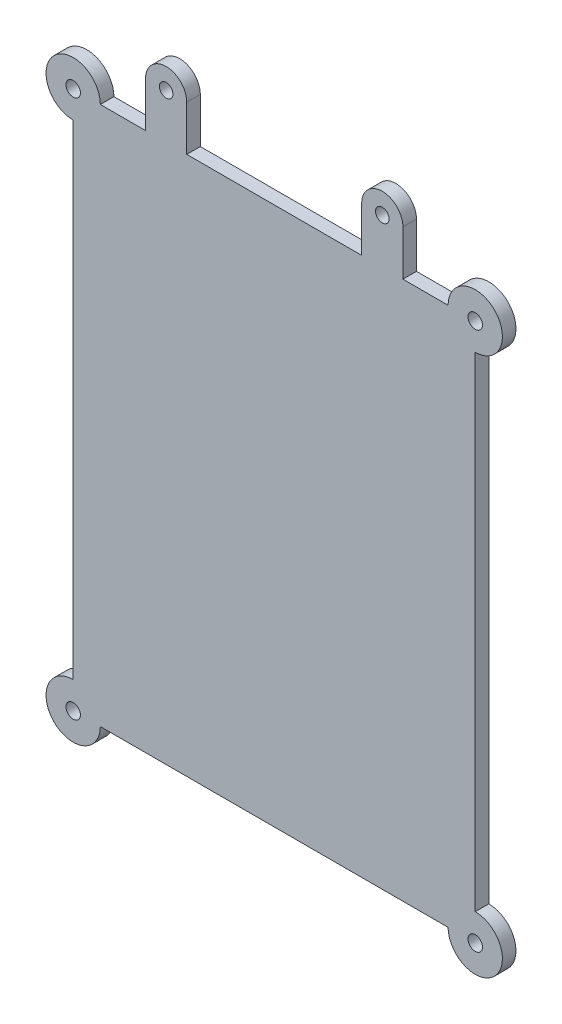
ISO-10303-21;
HEADER;
FILE_DESCRIPTION(('STEP AP214'),'2;1');
FILE_NAME('part.step','',(''),(''),'','','');
FILE_SCHEMA(('AUTOMOTIVE_DESIGN { 1 0 10303 214 1 1 1 1 }'));
ENDSEC;
DATA;
#1=APPLICATION_CONTEXT('core data for automotive mechanical design processes');
#2=APPLICATION_PROTOCOL_DEFINITION('international standard','automotive_design',2000,#1);
#3=PRODUCT_CONTEXT('',#1,'mechanical');
#4=PRODUCT('Part','Part','',(#3));
#5=PRODUCT_RELATED_PRODUCT_CATEGORY('part','',(#4));
#6=PRODUCT_DEFINITION_FORMATION('','',#4);
#7=PRODUCT_DEFINITION_CONTEXT('part definition',#1,'design');
#8=PRODUCT_DEFINITION('design','',#6,#7);
#9=PRODUCT_DEFINITION_SHAPE('','',#8);
#10=(LENGTH_UNIT() NAMED_UNIT(*) SI_UNIT(.MILLI.,.METRE.));
#11=(NAMED_UNIT(*) PLANE_ANGLE_UNIT() SI_UNIT($,.RADIAN.));
#12=(NAMED_UNIT(*) SI_UNIT($,.STERADIAN.) SOLID_ANGLE_UNIT());
#13=UNCERTAINTY_MEASURE_WITH_UNIT(LENGTH_MEASURE(1.E-05),#10,'distance_accuracy_value','');
#14=(GEOMETRIC_REPRESENTATION_CONTEXT(3) GLOBAL_UNCERTAINTY_ASSIGNED_CONTEXT((#13)) GLOBAL_UNIT_ASSIGNED_CONTEXT((#10,
#11,#12)) REPRESENTATION_CONTEXT('',''));
#15=CARTESIAN_POINT('',(0.,0.,0.));
#16=DIRECTION('',(0.,0.,1.));
#17=DIRECTION('',(1.,0.,0.));
#18=AXIS2_PLACEMENT_3D('',#15,#16,#17);
#19=CARTESIAN_POINT('',(-38.4588537318775,59.5709641012657,3.));
#20=DIRECTION('',(0.,-1.,0.));
#21=DIRECTION('',(0.,0.,-1.));
#22=AXIS2_PLACEMENT_3D('',#19,#20,#21);
#23=PLANE('',#22);
#24=DIRECTION('',(-1.,0.,0.));
#25=VECTOR('',#24,1.);
#26=CARTESIAN_POINT('',(-38.4588537318775,59.5709641012657,0.));
#27=LINE('',#26,#25);
#28=CARTESIAN_POINT('',(19.3447841516003,59.5709641012657,0.));
#29=VERTEX_POINT('',#28);
#30=CARTESIAN_POINT('',(-19.3447841516003,59.5709641012657,0.));
#31=VERTEX_POINT('',#30);
#32=EDGE_CURVE('E269',#29,#31,#27,.T.);
#33=ORIENTED_EDGE('',*,*,#32,.T.);
#34=DIRECTION('',(0.,0.,1.));
#35=VECTOR('',#34,1.);
#36=CARTESIAN_POINT('',(-19.3447841516003,59.5709641012657,0.));
#37=LINE('',#36,#35);
#38=CARTESIAN_POINT('',(-19.3447841516003,59.5709641012657,3.));
#39=VERTEX_POINT('',#38);
#40=EDGE_CURVE('E60',#31,#39,#37,.T.);
#41=ORIENTED_EDGE('',*,*,#40,.T.);
#42=DIRECTION('',(-1.,0.,0.));
#43=VECTOR('',#42,1.);
#44=CARTESIAN_POINT('',(-38.4588537318775,59.5709641012657,3.));
#45=LINE('',#44,#43);
#46=CARTESIAN_POINT('',(19.3447841516003,59.5709641012657,3.));
#47=VERTEX_POINT('',#46);
#48=EDGE_CURVE('E249',#47,#39,#45,.T.);
#49=ORIENTED_EDGE('',*,*,#48,.F.);
#50=DIRECTION('',(0.,0.,1.));
#51=VECTOR('',#50,1.);
#52=CARTESIAN_POINT('',(19.3447841516003,59.5709641012657,0.));
#53=LINE('',#52,#51);
#54=EDGE_CURVE('E208',#29,#47,#53,.T.);
#55=ORIENTED_EDGE('',*,*,#54,.F.);
#56=EDGE_LOOP('',(#33,#41,#49,#55));
#57=FACE_BOUND('',#56,.T.);
#58=ADVANCED_FACE('F35',(#57),#23,.F.);
#59=CARTESIAN_POINT('',(-28.4588537318775,59.5709641012657,3.));
#60=VERTEX_POINT('',#59);
#61=CARTESIAN_POINT('',(-38.4588537318775,59.5709641012657,3.));
#62=VERTEX_POINT('',#61);
#63=EDGE_CURVE('E52',#60,#62,#45,.T.);
#64=ORIENTED_EDGE('',*,*,#63,.F.);
#65=DIRECTION('',(0.,0.,1.));
#66=VECTOR('',#65,1.);
#67=CARTESIAN_POINT('',(-28.4588537318775,59.5709641012657,0.));
#68=LINE('',#67,#66);
#69=CARTESIAN_POINT('',(-28.4588537318775,59.5709641012657,0.));
#70=VERTEX_POINT('',#69);
#71=EDGE_CURVE('E189',#70,#60,#68,.T.);
#72=ORIENTED_EDGE('',*,*,#71,.F.);
#73=CARTESIAN_POINT('',(-38.4588537318775,59.5709641012657,0.));
#74=VERTEX_POINT('',#73);
#75=EDGE_CURVE('E265',#70,#74,#27,.T.);
#76=ORIENTED_EDGE('',*,*,#75,.T.);
#77=DIRECTION('',(0.,0.,-1.));
#78=VECTOR('',#77,1.);
#79=CARTESIAN_POINT('',(-38.4588537318775,59.5709641012657,3.));
#80=LINE('',#79,#78);
#81=EDGE_CURVE('E287',#62,#74,#80,.T.);
#82=ORIENTED_EDGE('',*,*,#81,.F.);
#83=EDGE_LOOP('',(#64,#72,#76,#82));
#84=FACE_BOUND('',#83,.T.);
#85=ADVANCED_FACE('F325',(#84),#23,.F.);
#86=CARTESIAN_POINT('',(44.4588537318775,-59.5709641012657,3.));
#87=DIRECTION('',(0.,0.,-1.));
#88=DIRECTION('',(-1.,0.,0.));
#89=AXIS2_PLACEMENT_3D('',#86,#87,#88);
#90=CYLINDRICAL_SURFACE('',#89,6.00000000000001);
#91=CARTESIAN_POINT('',(44.4588537318775,-59.5709641012657,0.));
#92=DIRECTION('',(0.,0.,1.));
#93=DIRECTION('',(1.,0.,0.));
#94=AXIS2_PLACEMENT_3D('',#91,#92,#93);
#95=CIRCLE('',#94,6.00000000000001);
#96=CARTESIAN_POINT('',(38.4588537318775,-59.5709641012657,0.));
#97=VERTEX_POINT('',#96);
#98=CARTESIAN_POINT('',(44.4588537318775,-53.5709641012657,0.));
#99=VERTEX_POINT('',#98);
#100=EDGE_CURVE('E258',#97,#99,#95,.T.);
#101=ORIENTED_EDGE('',*,*,#100,.T.);
#102=DIRECTION('',(0.,0.,-1.));
#103=VECTOR('',#102,1.);
#104=CARTESIAN_POINT('',(44.4588537318775,-53.5709641012657,3.));
#105=LINE('',#104,#103);
#106=CARTESIAN_POINT('',(44.4588537318775,-53.5709641012657,3.));
#107=VERTEX_POINT('',#106);
#108=EDGE_CURVE('E11',#107,#99,#105,.T.);
#109=ORIENTED_EDGE('',*,*,#108,.F.);
#110=CARTESIAN_POINT('',(44.4588537318775,-59.5709641012657,3.));
#111=DIRECTION('',(0.,0.,1.));
#112=DIRECTION('',(1.,0.,0.));
#113=AXIS2_PLACEMENT_3D('',#110,#111,#112);
#114=CIRCLE('',#113,6.00000000000001);
#115=CARTESIAN_POINT('',(38.4588537318775,-59.5709641012657,3.));
#116=VERTEX_POINT('',#115);
#117=EDGE_CURVE('E237',#116,#107,#114,.T.);
#118=ORIENTED_EDGE('',*,*,#117,.F.);
#119=DIRECTION('',(0.,0.,-1.));
#120=VECTOR('',#119,1.);
#121=CARTESIAN_POINT('',(38.4588537318775,-59.5709641012657,3.));
#122=LINE('',#121,#120);
#123=EDGE_CURVE('E257',#116,#97,#122,.T.);
#124=ORIENTED_EDGE('',*,*,#123,.T.);
#125=EDGE_LOOP('',(#101,#109,#118,#124));
#126=FACE_BOUND('',#125,.T.);
#127=ADVANCED_FACE('F37',(#126),#90,.T.);
#128=CARTESIAN_POINT('',(44.4588537318775,53.5709641012657,3.));
#129=DIRECTION('',(-1.,0.,0.));
#130=DIRECTION('',(0.,0.,1.));
#131=AXIS2_PLACEMENT_3D('',#128,#129,#130);
#132=PLANE('',#131);
#133=DIRECTION('',(0.,1.,0.));
#134=VECTOR('',#133,1.);
#135=CARTESIAN_POINT('',(44.4588537318775,53.5709641012657,0.));
#136=LINE('',#135,#134);
#137=CARTESIAN_POINT('',(44.4588537318775,53.5709641012657,0.));
#138=VERTEX_POINT('',#137);
#139=EDGE_CURVE('E261',#99,#138,#136,.T.);
#140=ORIENTED_EDGE('',*,*,#139,.T.);
#141=DIRECTION('',(0.,0.,-1.));
#142=VECTOR('',#141,1.);
#143=CARTESIAN_POINT('',(44.4588537318775,53.5709641012657,3.));
#144=LINE('',#143,#142);
#145=CARTESIAN_POINT('',(44.4588537318775,53.5709641012657,3.));
#146=VERTEX_POINT('',#145);
#147=EDGE_CURVE('E44',#146,#138,#144,.T.);
#148=ORIENTED_EDGE('',*,*,#147,.F.);
#149=DIRECTION('',(0.,1.,0.));
#150=VECTOR('',#149,1.);
#151=CARTESIAN_POINT('',(44.4588537318775,53.5709641012657,3.));
#152=LINE('',#151,#150);
#153=EDGE_CURVE('E240',#107,#146,#152,.T.);
#154=ORIENTED_EDGE('',*,*,#153,.F.);
#155=ORIENTED_EDGE('',*,*,#108,.T.);
#156=EDGE_LOOP('',(#140,#148,#154,#155));
#157=FACE_BOUND('',#156,.T.);
#158=ADVANCED_FACE('F343',(#157),#132,.F.);
#159=CARTESIAN_POINT('',(44.4588537318775,59.5709641012657,3.));
#160=DIRECTION('',(0.,0.,-1.));
#161=DIRECTION('',(-1.,0.,0.));
#162=AXIS2_PLACEMENT_3D('',#159,#160,#161);
#163=CYLINDRICAL_SURFACE('',#162,6.00000000000001);
#164=CARTESIAN_POINT('',(44.4588537318775,59.5709641012657,0.));
#165=DIRECTION('',(0.,0.,1.));
#166=DIRECTION('',(1.,0.,0.));
#167=AXIS2_PLACEMENT_3D('',#164,#165,#166);
#168=CIRCLE('',#167,6.00000000000001);
#169=CARTESIAN_POINT('',(38.4588537318775,59.5709641012657,0.));
#170=VERTEX_POINT('',#169);
#171=EDGE_CURVE('E263',#138,#170,#168,.T.);
#172=ORIENTED_EDGE('',*,*,#171,.T.);
#173=DIRECTION('',(0.,0.,-1.));
#174=VECTOR('',#173,1.);
#175=CARTESIAN_POINT('',(38.4588537318775,59.5709641012657,3.));
#176=LINE('',#175,#174);
#177=CARTESIAN_POINT('',(38.4588537318775,59.5709641012657,3.));
#178=VERTEX_POINT('',#177);
#179=EDGE_CURVE('E290',#178,#170,#176,.T.);
#180=ORIENTED_EDGE('',*,*,#179,.F.);
#181=CARTESIAN_POINT('',(44.4588537318775,59.5709641012657,3.));
#182=DIRECTION('',(0.,0.,1.));
#183=DIRECTION('',(1.,0.,0.));
#184=AXIS2_PLACEMENT_3D('',#181,#182,#183);
#185=CIRCLE('',#184,6.00000000000001);
#186=EDGE_CURVE('E243',#146,#178,#185,.T.);
#187=ORIENTED_EDGE('',*,*,#186,.F.);
#188=ORIENTED_EDGE('',*,*,#147,.T.);
#189=EDGE_LOOP('',(#172,#180,#187,#188));
#190=FACE_BOUND('',#189,.T.);
#191=ADVANCED_FACE('F335',(#190),#163,.T.);
#192=CARTESIAN_POINT('',(28.4588537318775,59.5709641012657,0.));
#193=VERTEX_POINT('',#192);
#194=EDGE_CURVE('E266',#170,#193,#27,.T.);
#195=ORIENTED_EDGE('',*,*,#194,.T.);
#196=DIRECTION('',(0.,0.,1.));
#197=VECTOR('',#196,1.);
#198=CARTESIAN_POINT('',(28.4588537318775,59.5709641012657,0.));
#199=LINE('',#198,#197);
#200=CARTESIAN_POINT('',(28.4588537318775,59.5709641012657,3.));
#201=VERTEX_POINT('',#200);
#202=EDGE_CURVE('E221',#193,#201,#199,.T.);
#203=ORIENTED_EDGE('',*,*,#202,.T.);
#204=EDGE_CURVE('E245',#178,#201,#45,.T.);
#205=ORIENTED_EDGE('',*,*,#204,.F.);
#206=ORIENTED_EDGE('',*,*,#179,.T.);
#207=EDGE_LOOP('',(#195,#203,#205,#206));
#208=FACE_BOUND('',#207,.T.);
#209=ADVANCED_FACE('F327',(#208),#23,.F.);
#210=CARTESIAN_POINT('',(-44.4588537318775,59.5709641012657,3.));
#211=DIRECTION('',(0.,0.,-1.));
#212=DIRECTION('',(-1.,0.,0.));
#213=AXIS2_PLACEMENT_3D('',#210,#211,#212);
#214=CYLINDRICAL_SURFACE('',#213,6.00000000000001);
#215=CARTESIAN_POINT('',(-44.4588537318775,59.5709641012657,0.));
#216=DIRECTION('',(0.,0.,1.));
#217=DIRECTION('',(1.,0.,0.));
#218=AXIS2_PLACEMENT_3D('',#215,#216,#217);
#219=CIRCLE('',#218,6.00000000000001);
#220=CARTESIAN_POINT('',(-44.4588537318775,53.5709641012657,0.));
#221=VERTEX_POINT('',#220);
#222=EDGE_CURVE('E268',#74,#221,#219,.T.);
#223=ORIENTED_EDGE('',*,*,#222,.T.);
#224=DIRECTION('',(0.,0.,-1.));
#225=VECTOR('',#224,1.);
#226=CARTESIAN_POINT('',(-44.4588537318775,53.5709641012657,3.));
#227=LINE('',#226,#225);
#228=CARTESIAN_POINT('',(-44.4588537318775,53.5709641012657,3.));
#229=VERTEX_POINT('',#228);
#230=EDGE_CURVE('E284',#229,#221,#227,.T.);
#231=ORIENTED_EDGE('',*,*,#230,.F.);
#232=CARTESIAN_POINT('',(-44.4588537318775,59.5709641012657,3.));
#233=DIRECTION('',(0.,0.,1.));
#234=DIRECTION('',(1.,0.,0.));
#235=AXIS2_PLACEMENT_3D('',#232,#233,#234);
#236=CIRCLE('',#235,6.00000000000001);
#237=EDGE_CURVE('E248',#62,#229,#236,.T.);
#238=ORIENTED_EDGE('',*,*,#237,.F.);
#239=ORIENTED_EDGE('',*,*,#81,.T.);
#240=EDGE_LOOP('',(#223,#231,#238,#239));
#241=FACE_BOUND('',#240,.T.);
#242=ADVANCED_FACE('F334',(#241),#214,.T.);
#243=CARTESIAN_POINT('',(-44.4588537318775,-53.5709641012657,3.));
#244=DIRECTION('',(1.,0.,0.));
#245=DIRECTION('',(0.,0.,-1.));
#246=AXIS2_PLACEMENT_3D('',#243,#244,#245);
#247=PLANE('',#246);
#248=DIRECTION('',(0.,-1.,0.));
#249=VECTOR('',#248,1.);
#250=CARTESIAN_POINT('',(-44.4588537318775,-53.5709641012657,0.));
#251=LINE('',#250,#249);
#252=CARTESIAN_POINT('',(-44.4588537318775,-53.5709641012657,0.));
#253=VERTEX_POINT('',#252);
#254=EDGE_CURVE('E271',#221,#253,#251,.T.);
#255=ORIENTED_EDGE('',*,*,#254,.T.);
#256=DIRECTION('',(0.,0.,-1.));
#257=VECTOR('',#256,1.);
#258=CARTESIAN_POINT('',(-44.4588537318775,-53.5709641012657,3.));
#259=LINE('',#258,#257);
#260=CARTESIAN_POINT('',(-44.4588537318775,-53.5709641012657,3.));
#261=VERTEX_POINT('',#260);
#262=EDGE_CURVE('E281',#261,#253,#259,.T.);
#263=ORIENTED_EDGE('',*,*,#262,.F.);
#264=DIRECTION('',(0.,-1.,0.));
#265=VECTOR('',#264,1.);
#266=CARTESIAN_POINT('',(-44.4588537318775,-53.5709641012657,3.));
#267=LINE('',#266,#265);
#268=EDGE_CURVE('E251',#229,#261,#267,.T.);
#269=ORIENTED_EDGE('',*,*,#268,.F.);
#270=ORIENTED_EDGE('',*,*,#230,.T.);
#271=EDGE_LOOP('',(#255,#263,#269,#270));
#272=FACE_BOUND('',#271,.T.);
#273=ADVANCED_FACE('F341',(#272),#247,.F.);
#274=CARTESIAN_POINT('',(-44.4588537318775,-59.5709641012657,3.));
#275=DIRECTION('',(0.,0.,-1.));
#276=DIRECTION('',(-1.,0.,0.));
#277=AXIS2_PLACEMENT_3D('',#274,#275,#276);
#278=CYLINDRICAL_SURFACE('',#277,6.00000000000001);
#279=CARTESIAN_POINT('',(-44.4588537318775,-59.5709641012657,0.));
#280=DIRECTION('',(0.,0.,1.));
#281=DIRECTION('',(1.,0.,0.));
#282=AXIS2_PLACEMENT_3D('',#279,#280,#281);
#283=CIRCLE('',#282,6.00000000000001);
#284=CARTESIAN_POINT('',(-38.4588537318775,-59.5709641012657,0.));
#285=VERTEX_POINT('',#284);
#286=EDGE_CURVE('E273',#253,#285,#283,.T.);
#287=ORIENTED_EDGE('',*,*,#286,.T.);
#288=DIRECTION('',(0.,0.,-1.));
#289=VECTOR('',#288,1.);
#290=CARTESIAN_POINT('',(-38.4588537318775,-59.5709641012657,3.));
#291=LINE('',#290,#289);
#292=CARTESIAN_POINT('',(-38.4588537318775,-59.5709641012657,3.));
#293=VERTEX_POINT('',#292);
#294=EDGE_CURVE('E278',#293,#285,#291,.T.);
#295=ORIENTED_EDGE('',*,*,#294,.F.);
#296=CARTESIAN_POINT('',(-44.4588537318775,-59.5709641012657,3.));
#297=DIRECTION('',(0.,0.,1.));
#298=DIRECTION('',(1.,0.,0.));
#299=AXIS2_PLACEMENT_3D('',#296,#297,#298);
#300=CIRCLE('',#299,6.00000000000001);
#301=EDGE_CURVE('E253',#261,#293,#300,.T.);
#302=ORIENTED_EDGE('',*,*,#301,.F.);
#303=ORIENTED_EDGE('',*,*,#262,.T.);
#304=EDGE_LOOP('',(#287,#295,#302,#303));
#305=FACE_BOUND('',#304,.T.);
#306=ADVANCED_FACE('F378',(#305),#278,.T.);
#307=CARTESIAN_POINT('',(38.4588537318775,-59.5709641012657,3.));
#308=DIRECTION('',(0.,1.,0.));
#309=DIRECTION('',(0.,0.,1.));
#310=AXIS2_PLACEMENT_3D('',#307,#308,#309);
#311=PLANE('',#310);
#312=DIRECTION('',(1.,0.,0.));
#313=VECTOR('',#312,1.);
#314=CARTESIAN_POINT('',(38.4588537318775,-59.5709641012657,0.));
#315=LINE('',#314,#313);
#316=EDGE_CURVE('E241',#285,#97,#315,.T.);
#317=ORIENTED_EDGE('',*,*,#316,.T.);
#318=ORIENTED_EDGE('',*,*,#123,.F.);
#319=DIRECTION('',(1.,0.,0.));
#320=VECTOR('',#319,1.);
#321=CARTESIAN_POINT('',(38.4588537318775,-59.5709641012657,3.));
#322=LINE('',#321,#320);
#323=EDGE_CURVE('E255',#293,#116,#322,.T.);
#324=ORIENTED_EDGE('',*,*,#323,.F.);
#325=ORIENTED_EDGE('',*,*,#294,.T.);
#326=EDGE_LOOP('',(#317,#318,#324,#325));
#327=FACE_BOUND('',#326,.T.);
#328=ADVANCED_FACE('F372',(#327),#311,.F.);
#329=CARTESIAN_POINT('',(44.4588537318775,-59.5709641012657,3.));
#330=DIRECTION('',(0.,0.,1.));
#331=DIRECTION('',(1.,0.,0.));
#332=AXIS2_PLACEMENT_3D('',#329,#330,#331);
#333=PLANE('',#332);
#334=CARTESIAN_POINT('',(-44.4588537318775,-59.5709641012657,3.));
#335=DIRECTION('',(0.,0.,1.));
#336=DIRECTION('',(1.,0.,0.));
#337=AXIS2_PLACEMENT_3D('',#334,#335,#336);
#338=CIRCLE('',#337,1.6);
#339=CARTESIAN_POINT('',(-42.8588537318775,-59.5709641012657,3.));
#340=VERTEX_POINT('',#339);
#341=EDGE_CURVE('E218',#340,#340,#338,.T.);
#342=ORIENTED_EDGE('',*,*,#341,.F.);
#343=EDGE_LOOP('',(#342));
#344=FACE_BOUND('',#343,.T.);
#345=CARTESIAN_POINT('',(44.4588537318775,-59.5709641012657,3.));
#346=DIRECTION('',(0.,0.,1.));
#347=DIRECTION('',(1.,0.,0.));
#348=AXIS2_PLACEMENT_3D('',#345,#346,#347);
#349=CIRCLE('',#348,1.6);
#350=CARTESIAN_POINT('',(46.0588537318775,-59.5709641012657,3.));
#351=VERTEX_POINT('',#350);
#352=EDGE_CURVE('E229',#351,#351,#349,.T.);
#353=ORIENTED_EDGE('',*,*,#352,.F.);
#354=EDGE_LOOP('',(#353));
#355=FACE_BOUND('',#354,.T.);
#356=CARTESIAN_POINT('',(44.4588537318775,59.5709641012657,3.));
#357=DIRECTION('',(0.,0.,1.));
#358=DIRECTION('',(1.,0.,0.));
#359=AXIS2_PLACEMENT_3D('',#356,#357,#358);
#360=CIRCLE('',#359,1.6);
#361=CARTESIAN_POINT('',(46.0588537318775,59.5709641012657,3.));
#362=VERTEX_POINT('',#361);
#363=EDGE_CURVE('E225',#362,#362,#360,.T.);
#364=ORIENTED_EDGE('',*,*,#363,.F.);
#365=EDGE_LOOP('',(#364));
#366=FACE_BOUND('',#365,.T.);
#367=CARTESIAN_POINT('',(-44.4588537318775,59.5709641012657,3.));
#368=DIRECTION('',(0.,0.,1.));
#369=DIRECTION('',(1.,0.,0.));
#370=AXIS2_PLACEMENT_3D('',#367,#368,#369);
#371=CIRCLE('',#370,1.6);
#372=CARTESIAN_POINT('',(-42.8588537318775,59.5709641012657,3.));
#373=VERTEX_POINT('',#372);
#374=EDGE_CURVE('E228',#373,#373,#371,.T.);
#375=ORIENTED_EDGE('',*,*,#374,.F.);
#376=EDGE_LOOP('',(#375));
#377=FACE_BOUND('',#376,.T.);
#378=ORIENTED_EDGE('',*,*,#117,.T.);
#379=ORIENTED_EDGE('',*,*,#153,.T.);
#380=ORIENTED_EDGE('',*,*,#186,.T.);
#381=ORIENTED_EDGE('',*,*,#204,.T.);
#382=DIRECTION('',(0.,1.,0.));
#383=VECTOR('',#382,1.);
#384=CARTESIAN_POINT('',(28.4588537318775,59.5709641012657,3.));
#385=LINE('',#384,#383);
#386=CARTESIAN_POINT('',(28.4588537318775,69.5709641012657,3.));
#387=VERTEX_POINT('',#386);
#388=EDGE_CURVE('E211',#201,#387,#385,.T.);
#389=ORIENTED_EDGE('',*,*,#388,.T.);
#390=CARTESIAN_POINT('',(23.9018189417389,69.5709641012657,3.));
#391=DIRECTION('',(0.,0.,1.));
#392=DIRECTION('',(1.,0.,0.));
#393=AXIS2_PLACEMENT_3D('',#390,#391,#392);
#394=CIRCLE('',#393,4.55703479013857);
#395=CARTESIAN_POINT('',(19.3447841516003,69.5709641012657,3.));
#396=VERTEX_POINT('',#395);
#397=EDGE_CURVE('E202',#387,#396,#394,.T.);
#398=ORIENTED_EDGE('',*,*,#397,.T.);
#399=DIRECTION('',(0.,-1.,0.));
#400=VECTOR('',#399,1.);
#401=CARTESIAN_POINT('',(19.3447841516003,59.5709641012657,3.));
#402=LINE('',#401,#400);
#403=EDGE_CURVE('E195',#396,#47,#402,.T.);
#404=ORIENTED_EDGE('',*,*,#403,.T.);
#405=ORIENTED_EDGE('',*,*,#48,.T.);
#406=DIRECTION('',(0.,1.,0.));
#407=VECTOR('',#406,1.);
#408=CARTESIAN_POINT('',(-19.3447841516003,59.5709641012657,3.));
#409=LINE('',#408,#407);
#410=CARTESIAN_POINT('',(-19.3447841516003,69.5709641012657,3.));
#411=VERTEX_POINT('',#410);
#412=EDGE_CURVE('E183',#39,#411,#409,.T.);
#413=ORIENTED_EDGE('',*,*,#412,.T.);
#414=CARTESIAN_POINT('',(-23.9018189417389,69.5709641012657,3.));
#415=DIRECTION('',(0.,0.,1.));
#416=DIRECTION('',(-1.,0.,0.));
#417=AXIS2_PLACEMENT_3D('',#414,#415,#416);
#418=CIRCLE('',#417,4.55703479013857);
#419=CARTESIAN_POINT('',(-28.4588537318775,69.5709641012657,3.));
#420=VERTEX_POINT('',#419);
#421=EDGE_CURVE('E156',#411,#420,#418,.T.);
#422=ORIENTED_EDGE('',*,*,#421,.T.);
#423=DIRECTION('',(0.,-1.,0.));
#424=VECTOR('',#423,1.);
#425=CARTESIAN_POINT('',(-28.4588537318775,59.5709641012657,3.));
#426=LINE('',#425,#424);
#427=EDGE_CURVE('E174',#420,#60,#426,.T.);
#428=ORIENTED_EDGE('',*,*,#427,.T.);
#429=ORIENTED_EDGE('',*,*,#63,.T.);
#430=ORIENTED_EDGE('',*,*,#237,.T.);
#431=ORIENTED_EDGE('',*,*,#268,.T.);
#432=ORIENTED_EDGE('',*,*,#301,.T.);
#433=ORIENTED_EDGE('',*,*,#323,.T.);
#434=EDGE_LOOP('',(#378,#379,#380,#381,#389,#398,#404,#405,#413,#422,#428,#429,#430,#431,#432,#433));
#435=FACE_BOUND('',#434,.T.);
#436=CARTESIAN_POINT('',(23.9018189417389,69.5709641012657,3.));
#437=DIRECTION('',(0.,0.,1.));
#438=DIRECTION('',(1.,0.,0.));
#439=AXIS2_PLACEMENT_3D('',#436,#437,#438);
#440=CIRCLE('',#439,1.5);
#441=CARTESIAN_POINT('',(25.4018189417389,69.5709641012657,3.));
#442=VERTEX_POINT('',#441);
#443=EDGE_CURVE('E188',#442,#442,#440,.T.);
#444=ORIENTED_EDGE('',*,*,#443,.F.);
#445=EDGE_LOOP('',(#444));
#446=FACE_BOUND('',#445,.T.);
#447=CARTESIAN_POINT('',(-23.9018189417389,69.5709641012657,3.));
#448=DIRECTION('',(0.,0.,1.));
#449=DIRECTION('',(-1.,0.,0.));
#450=AXIS2_PLACEMENT_3D('',#447,#448,#449);
#451=CIRCLE('',#450,1.5);
#452=CARTESIAN_POINT('',(-25.4018189417389,69.5709641012657,3.));
#453=VERTEX_POINT('',#452);
#454=EDGE_CURVE('E179',#453,#453,#451,.T.);
#455=ORIENTED_EDGE('',*,*,#454,.F.);
#456=EDGE_LOOP('',(#455));
#457=FACE_BOUND('',#456,.T.);
#458=ADVANCED_FACE('F360',(#344,#355,#366,#377,#435,#446,#457),#333,.T.);
#459=CARTESIAN_POINT('',(44.4588537318775,-59.5709641012657,0.));
#460=DIRECTION('',(0.,0.,1.));
#461=DIRECTION('',(1.,0.,0.));
#462=AXIS2_PLACEMENT_3D('',#459,#460,#461);
#463=PLANE('',#462);
#464=CARTESIAN_POINT('',(-44.4588537318775,-59.5709641012657,0.));
#465=DIRECTION('',(0.,0.,1.));
#466=DIRECTION('',(1.,0.,0.));
#467=AXIS2_PLACEMENT_3D('',#464,#465,#466);
#468=CIRCLE('',#467,1.6);
#469=CARTESIAN_POINT('',(-42.8588537318775,-59.5709641012657,0.));
#470=VERTEX_POINT('',#469);
#471=EDGE_CURVE('E39',#470,#470,#468,.T.);
#472=ORIENTED_EDGE('',*,*,#471,.T.);
#473=EDGE_LOOP('',(#472));
#474=FACE_BOUND('',#473,.T.);
#475=CARTESIAN_POINT('',(44.4588537318775,-59.5709641012657,0.));
#476=DIRECTION('',(0.,0.,1.));
#477=DIRECTION('',(1.,0.,0.));
#478=AXIS2_PLACEMENT_3D('',#475,#476,#477);
#479=CIRCLE('',#478,1.6);
#480=CARTESIAN_POINT('',(46.0588537318775,-59.5709641012657,0.));
#481=VERTEX_POINT('',#480);
#482=EDGE_CURVE('E299',#481,#481,#479,.T.);
#483=ORIENTED_EDGE('',*,*,#482,.T.);
#484=EDGE_LOOP('',(#483));
#485=FACE_BOUND('',#484,.T.);
#486=CARTESIAN_POINT('',(44.4588537318775,59.5709641012657,0.));
#487=DIRECTION('',(0.,0.,1.));
#488=DIRECTION('',(1.,0.,0.));
#489=AXIS2_PLACEMENT_3D('',#486,#487,#488);
#490=CIRCLE('',#489,1.6);
#491=CARTESIAN_POINT('',(46.0588537318775,59.5709641012657,0.));
#492=VERTEX_POINT('',#491);
#493=EDGE_CURVE('E297',#492,#492,#490,.T.);
#494=ORIENTED_EDGE('',*,*,#493,.T.);
#495=EDGE_LOOP('',(#494));
#496=FACE_BOUND('',#495,.T.);
#497=CARTESIAN_POINT('',(-44.4588537318775,59.5709641012657,0.));
#498=DIRECTION('',(0.,0.,1.));
#499=DIRECTION('',(1.,0.,0.));
#500=AXIS2_PLACEMENT_3D('',#497,#498,#499);
#501=CIRCLE('',#500,1.6);
#502=CARTESIAN_POINT('',(-42.8588537318775,59.5709641012657,0.));
#503=VERTEX_POINT('',#502);
#504=EDGE_CURVE('E236',#503,#503,#501,.T.);
#505=ORIENTED_EDGE('',*,*,#504,.T.);
#506=EDGE_LOOP('',(#505));
#507=FACE_BOUND('',#506,.T.);
#508=ORIENTED_EDGE('',*,*,#100,.F.);
#509=ORIENTED_EDGE('',*,*,#316,.F.);
#510=ORIENTED_EDGE('',*,*,#286,.F.);
#511=ORIENTED_EDGE('',*,*,#254,.F.);
#512=ORIENTED_EDGE('',*,*,#222,.F.);
#513=ORIENTED_EDGE('',*,*,#75,.F.);
#514=DIRECTION('',(0.,-1.,0.));
#515=VECTOR('',#514,1.);
#516=CARTESIAN_POINT('',(-28.4588537318775,59.5709641012657,0.));
#517=LINE('',#516,#515);
#518=CARTESIAN_POINT('',(-28.4588537318775,69.5709641012657,0.));
#519=VERTEX_POINT('',#518);
#520=EDGE_CURVE('E162',#519,#70,#517,.T.);
#521=ORIENTED_EDGE('',*,*,#520,.F.);
#522=CARTESIAN_POINT('',(-23.9018189417389,69.5709641012657,0.));
#523=DIRECTION('',(0.,0.,1.));
#524=DIRECTION('',(-1.,0.,0.));
#525=AXIS2_PLACEMENT_3D('',#522,#523,#524);
#526=CIRCLE('',#525,4.55703479013857);
#527=CARTESIAN_POINT('',(-19.3447841516003,69.5709641012657,0.));
#528=VERTEX_POINT('',#527);
#529=EDGE_CURVE('E154',#528,#519,#526,.T.);
#530=ORIENTED_EDGE('',*,*,#529,.F.);
#531=DIRECTION('',(0.,1.,0.));
#532=VECTOR('',#531,1.);
#533=CARTESIAN_POINT('',(-19.3447841516003,59.5709641012657,0.));
#534=LINE('',#533,#532);
#535=EDGE_CURVE('E170',#31,#528,#534,.T.);
#536=ORIENTED_EDGE('',*,*,#535,.F.);
#537=ORIENTED_EDGE('',*,*,#32,.F.);
#538=DIRECTION('',(0.,-1.,0.));
#539=VECTOR('',#538,1.);
#540=CARTESIAN_POINT('',(19.3447841516003,59.5709641012657,0.));
#541=LINE('',#540,#539);
#542=CARTESIAN_POINT('',(19.3447841516003,69.5709641012657,0.));
#543=VERTEX_POINT('',#542);
#544=EDGE_CURVE('E198',#543,#29,#541,.T.);
#545=ORIENTED_EDGE('',*,*,#544,.F.);
#546=CARTESIAN_POINT('',(23.9018189417389,69.5709641012657,0.));
#547=DIRECTION('',(0.,0.,1.));
#548=DIRECTION('',(1.,0.,0.));
#549=AXIS2_PLACEMENT_3D('',#546,#547,#548);
#550=CIRCLE('',#549,4.55703479013857);
#551=CARTESIAN_POINT('',(28.4588537318775,69.5709641012657,0.));
#552=VERTEX_POINT('',#551);
#553=EDGE_CURVE('E205',#552,#543,#550,.T.);
#554=ORIENTED_EDGE('',*,*,#553,.F.);
#555=DIRECTION('',(0.,1.,0.));
#556=VECTOR('',#555,1.);
#557=CARTESIAN_POINT('',(28.4588537318775,59.5709641012657,0.));
#558=LINE('',#557,#556);
#559=EDGE_CURVE('E201',#193,#552,#558,.T.);
#560=ORIENTED_EDGE('',*,*,#559,.F.);
#561=ORIENTED_EDGE('',*,*,#194,.F.);
#562=ORIENTED_EDGE('',*,*,#171,.F.);
#563=ORIENTED_EDGE('',*,*,#139,.F.);
#564=EDGE_LOOP('',(#508,#509,#510,#511,#512,#513,#521,#530,#536,#537,#545,#554,#560,#561,#562,#563));
#565=FACE_BOUND('',#564,.T.);
#566=CARTESIAN_POINT('',(23.9018189417389,69.5709641012657,0.));
#567=DIRECTION('',(0.,0.,1.));
#568=DIRECTION('',(1.,0.,0.));
#569=AXIS2_PLACEMENT_3D('',#566,#567,#568);
#570=CIRCLE('',#569,1.5);
#571=CARTESIAN_POINT('',(25.4018189417389,69.5709641012657,0.));
#572=VERTEX_POINT('',#571);
#573=EDGE_CURVE('E192',#572,#572,#570,.T.);
#574=ORIENTED_EDGE('',*,*,#573,.T.);
#575=EDGE_LOOP('',(#574));
#576=FACE_BOUND('',#575,.T.);
#577=CARTESIAN_POINT('',(-23.9018189417389,69.5709641012657,0.));
#578=DIRECTION('',(0.,0.,1.));
#579=DIRECTION('',(-1.,0.,0.));
#580=AXIS2_PLACEMENT_3D('',#577,#578,#579);
#581=CIRCLE('',#580,1.5);
#582=CARTESIAN_POINT('',(-25.4018189417389,69.5709641012657,0.));
#583=VERTEX_POINT('',#582);
#584=EDGE_CURVE('E185',#583,#583,#581,.T.);
#585=ORIENTED_EDGE('',*,*,#584,.T.);
#586=EDGE_LOOP('',(#585));
#587=FACE_BOUND('',#586,.T.);
#588=ADVANCED_FACE('F168',(#474,#485,#496,#507,#565,#576,#587),#463,.F.);
#589=CARTESIAN_POINT('',(-44.4588537318775,59.5709641012657,-7.));
#590=DIRECTION('',(0.,0.,1.));
#591=DIRECTION('',(1.,0.,0.));
#592=AXIS2_PLACEMENT_3D('',#589,#590,#591);
#593=CYLINDRICAL_SURFACE('',#592,1.6);
#594=ORIENTED_EDGE('',*,*,#374,.T.);
#595=EDGE_LOOP('',(#594));
#596=FACE_BOUND('',#595,.T.);
#597=ORIENTED_EDGE('',*,*,#504,.F.);
#598=EDGE_LOOP('',(#597));
#599=FACE_BOUND('',#598,.T.);
#600=ADVANCED_FACE('F409',(#596,#599),#593,.F.);
#601=CARTESIAN_POINT('',(44.4588537318775,59.5709641012657,-7.));
#602=DIRECTION('',(0.,0.,1.));
#603=DIRECTION('',(1.,0.,0.));
#604=AXIS2_PLACEMENT_3D('',#601,#602,#603);
#605=CYLINDRICAL_SURFACE('',#604,1.6);
#606=ORIENTED_EDGE('',*,*,#363,.T.);
#607=EDGE_LOOP('',(#606));
#608=FACE_BOUND('',#607,.T.);
#609=ORIENTED_EDGE('',*,*,#493,.F.);
#610=EDGE_LOOP('',(#609));
#611=FACE_BOUND('',#610,.T.);
#612=ADVANCED_FACE('F320',(#608,#611),#605,.F.);
#613=CARTESIAN_POINT('',(44.4588537318775,-59.5709641012657,-7.));
#614=DIRECTION('',(0.,0.,1.));
#615=DIRECTION('',(1.,0.,0.));
#616=AXIS2_PLACEMENT_3D('',#613,#614,#615);
#617=CYLINDRICAL_SURFACE('',#616,1.6);
#618=ORIENTED_EDGE('',*,*,#352,.T.);
#619=EDGE_LOOP('',(#618));
#620=FACE_BOUND('',#619,.T.);
#621=ORIENTED_EDGE('',*,*,#482,.F.);
#622=EDGE_LOOP('',(#621));
#623=FACE_BOUND('',#622,.T.);
#624=ADVANCED_FACE('F310',(#620,#623),#617,.F.);
#625=CARTESIAN_POINT('',(-44.4588537318775,-59.5709641012657,-7.));
#626=DIRECTION('',(0.,0.,1.));
#627=DIRECTION('',(1.,0.,0.));
#628=AXIS2_PLACEMENT_3D('',#625,#626,#627);
#629=CYLINDRICAL_SURFACE('',#628,1.6);
#630=ORIENTED_EDGE('',*,*,#341,.T.);
#631=EDGE_LOOP('',(#630));
#632=FACE_BOUND('',#631,.T.);
#633=ORIENTED_EDGE('',*,*,#471,.F.);
#634=EDGE_LOOP('',(#633));
#635=FACE_BOUND('',#634,.T.);
#636=ADVANCED_FACE('F307',(#632,#635),#629,.F.);
#637=CARTESIAN_POINT('',(19.3447841516003,59.5709641012657,0.));
#638=DIRECTION('',(-1.,0.,0.));
#639=DIRECTION('',(0.,0.,1.));
#640=AXIS2_PLACEMENT_3D('',#637,#638,#639);
#641=PLANE('',#640);
#642=ORIENTED_EDGE('',*,*,#403,.F.);
#643=DIRECTION('',(0.,0.,1.));
#644=VECTOR('',#643,1.);
#645=CARTESIAN_POINT('',(19.3447841516003,69.5709641012657,0.));
#646=LINE('',#645,#644);
#647=EDGE_CURVE('E216',#543,#396,#646,.T.);
#648=ORIENTED_EDGE('',*,*,#647,.F.);
#649=ORIENTED_EDGE('',*,*,#544,.T.);
#650=ORIENTED_EDGE('',*,*,#54,.T.);
#651=EDGE_LOOP('',(#642,#648,#649,#650));
#652=FACE_BOUND('',#651,.T.);
#653=ADVANCED_FACE('F309',(#652),#641,.T.);
#654=CARTESIAN_POINT('',(23.9018189417389,69.5709641012657,0.));
#655=DIRECTION('',(0.,0.,1.));
#656=DIRECTION('',(1.,0.,0.));
#657=AXIS2_PLACEMENT_3D('',#654,#655,#656);
#658=CYLINDRICAL_SURFACE('',#657,4.55703479013857);
#659=ORIENTED_EDGE('',*,*,#397,.F.);
#660=DIRECTION('',(0.,0.,1.));
#661=VECTOR('',#660,1.);
#662=CARTESIAN_POINT('',(28.4588537318775,69.5709641012657,0.));
#663=LINE('',#662,#661);
#664=EDGE_CURVE('E219',#552,#387,#663,.T.);
#665=ORIENTED_EDGE('',*,*,#664,.F.);
#666=ORIENTED_EDGE('',*,*,#553,.T.);
#667=ORIENTED_EDGE('',*,*,#647,.T.);
#668=EDGE_LOOP('',(#659,#665,#666,#667));
#669=FACE_BOUND('',#668,.T.);
#670=ADVANCED_FACE('F317',(#669),#658,.T.);
#671=CARTESIAN_POINT('',(28.4588537318775,59.5709641012657,0.));
#672=DIRECTION('',(1.,0.,0.));
#673=DIRECTION('',(0.,0.,-1.));
#674=AXIS2_PLACEMENT_3D('',#671,#672,#673);
#675=PLANE('',#674);
#676=ORIENTED_EDGE('',*,*,#388,.F.);
#677=ORIENTED_EDGE('',*,*,#202,.F.);
#678=ORIENTED_EDGE('',*,*,#559,.T.);
#679=ORIENTED_EDGE('',*,*,#664,.T.);
#680=EDGE_LOOP('',(#676,#677,#678,#679));
#681=FACE_BOUND('',#680,.T.);
#682=ADVANCED_FACE('F353',(#681),#675,.T.);
#683=CARTESIAN_POINT('',(23.9018189417389,69.5709641012657,0.));
#684=DIRECTION('',(0.,0.,1.));
#685=DIRECTION('',(1.,0.,0.));
#686=AXIS2_PLACEMENT_3D('',#683,#684,#685);
#687=CYLINDRICAL_SURFACE('',#686,1.5);
#688=ORIENTED_EDGE('',*,*,#573,.F.);
#689=EDGE_LOOP('',(#688));
#690=FACE_BOUND('',#689,.T.);
#691=ORIENTED_EDGE('',*,*,#443,.T.);
#692=EDGE_LOOP('',(#691));
#693=FACE_BOUND('',#692,.T.);
#694=ADVANCED_FACE('F397',(#690,#693),#687,.F.);
#695=CARTESIAN_POINT('',(-19.3447841516003,59.5709641012657,0.));
#696=DIRECTION('',(1.,0.,0.));
#697=DIRECTION('',(0.,0.,-1.));
#698=AXIS2_PLACEMENT_3D('',#695,#696,#697);
#699=PLANE('',#698);
#700=ORIENTED_EDGE('',*,*,#412,.F.);
#701=ORIENTED_EDGE('',*,*,#40,.F.);
#702=ORIENTED_EDGE('',*,*,#535,.T.);
#703=DIRECTION('',(0.,0.,1.));
#704=VECTOR('',#703,1.);
#705=CARTESIAN_POINT('',(-19.3447841516003,69.5709641012657,0.));
#706=LINE('',#705,#704);
#707=EDGE_CURVE('E151',#528,#411,#706,.T.);
#708=ORIENTED_EDGE('',*,*,#707,.T.);
#709=EDGE_LOOP('',(#700,#701,#702,#708));
#710=FACE_BOUND('',#709,.T.);
#711=ADVANCED_FACE('F173',(#710),#699,.T.);
#712=CARTESIAN_POINT('',(-28.4588537318775,59.5709641012657,0.));
#713=DIRECTION('',(-1.,0.,0.));
#714=DIRECTION('',(0.,0.,1.));
#715=AXIS2_PLACEMENT_3D('',#712,#713,#714);
#716=PLANE('',#715);
#717=ORIENTED_EDGE('',*,*,#427,.F.);
#718=DIRECTION('',(0.,0.,1.));
#719=VECTOR('',#718,1.);
#720=CARTESIAN_POINT('',(-28.4588537318775,69.5709641012657,0.));
#721=LINE('',#720,#719);
#722=EDGE_CURVE('E161',#519,#420,#721,.T.);
#723=ORIENTED_EDGE('',*,*,#722,.F.);
#724=ORIENTED_EDGE('',*,*,#520,.T.);
#725=ORIENTED_EDGE('',*,*,#71,.T.);
#726=EDGE_LOOP('',(#717,#723,#724,#725));
#727=FACE_BOUND('',#726,.T.);
#728=ADVANCED_FACE('F387',(#727),#716,.T.);
#729=CARTESIAN_POINT('',(-23.9018189417389,69.5709641012657,0.));
#730=DIRECTION('',(0.,0.,1.));
#731=DIRECTION('',(1.,0.,0.));
#732=AXIS2_PLACEMENT_3D('',#729,#730,#731);
#733=CYLINDRICAL_SURFACE('',#732,4.55703479013857);
#734=ORIENTED_EDGE('',*,*,#421,.F.);
#735=ORIENTED_EDGE('',*,*,#707,.F.);
#736=ORIENTED_EDGE('',*,*,#529,.T.);
#737=ORIENTED_EDGE('',*,*,#722,.T.);
#738=EDGE_LOOP('',(#734,#735,#736,#737));
#739=FACE_BOUND('',#738,.T.);
#740=ADVANCED_FACE('F153',(#739),#733,.T.);
#741=CARTESIAN_POINT('',(-23.9018189417389,69.5709641012657,0.));
#742=DIRECTION('',(0.,0.,1.));
#743=DIRECTION('',(1.,0.,0.));
#744=AXIS2_PLACEMENT_3D('',#741,#742,#743);
#745=CYLINDRICAL_SURFACE('',#744,1.5);
#746=ORIENTED_EDGE('',*,*,#584,.F.);
#747=EDGE_LOOP('',(#746));
#748=FACE_BOUND('',#747,.T.);
#749=ORIENTED_EDGE('',*,*,#454,.T.);
#750=EDGE_LOOP('',(#749));
#751=FACE_BOUND('',#750,.T.);
#752=ADVANCED_FACE('F395',(#748,#751),#745,.F.);
#753=CLOSED_SHELL('',(#58,#85,#127,#158,#191,#209,#242,#273,#306,#328,#458,#588,#600,#612,#624,
#636,#653,#670,#682,#694,#711,#728,#740,#752));
#754=MANIFOLD_SOLID_BREP('B2',#753);
#755=ADVANCED_BREP_SHAPE_REPRESENTATION('',(#18,#754),#14);
#756=SHAPE_DEFINITION_REPRESENTATION(#9,#755);
ENDSEC;
END-ISO-10303-21;
